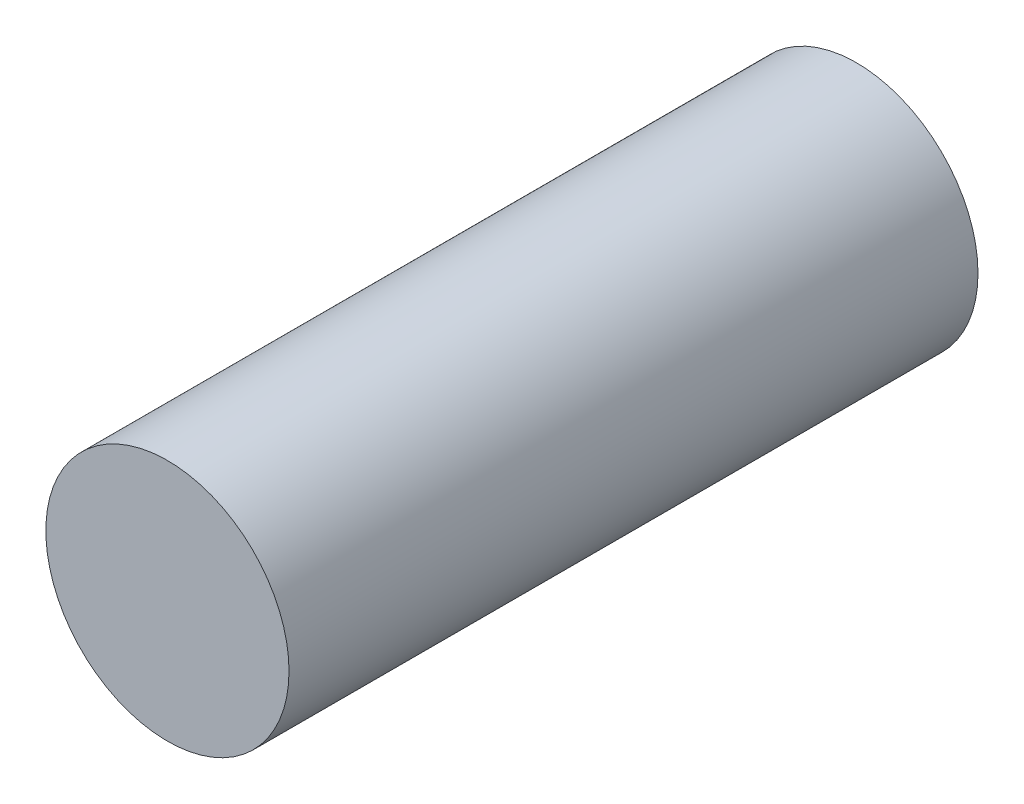
ISO-10303-21;
HEADER;
FILE_DESCRIPTION(('STEP AP214'),'2;1');
FILE_NAME('part.step','',(''),(''),'','','');
FILE_SCHEMA(('AUTOMOTIVE_DESIGN { 1 0 10303 214 1 1 1 1 }'));
ENDSEC;
DATA;
#1=APPLICATION_CONTEXT('core data for automotive mechanical design processes');
#2=APPLICATION_PROTOCOL_DEFINITION('international standard','automotive_design',2000,#1);
#3=PRODUCT_CONTEXT('',#1,'mechanical');
#4=PRODUCT('Part','Part','',(#3));
#5=PRODUCT_RELATED_PRODUCT_CATEGORY('part','',(#4));
#6=PRODUCT_DEFINITION_FORMATION('','',#4);
#7=PRODUCT_DEFINITION_CONTEXT('part definition',#1,'design');
#8=PRODUCT_DEFINITION('design','',#6,#7);
#9=PRODUCT_DEFINITION_SHAPE('','',#8);
#10=(LENGTH_UNIT() NAMED_UNIT(*) SI_UNIT(.MILLI.,.METRE.));
#11=(NAMED_UNIT(*) PLANE_ANGLE_UNIT() SI_UNIT($,.RADIAN.));
#12=(NAMED_UNIT(*) SI_UNIT($,.STERADIAN.) SOLID_ANGLE_UNIT());
#13=UNCERTAINTY_MEASURE_WITH_UNIT(LENGTH_MEASURE(1.E-05),#10,'distance_accuracy_value','');
#14=(GEOMETRIC_REPRESENTATION_CONTEXT(3) GLOBAL_UNCERTAINTY_ASSIGNED_CONTEXT((#13)) GLOBAL_UNIT_ASSIGNED_CONTEXT((#10,
#11,#12)) REPRESENTATION_CONTEXT('',''));
#15=CARTESIAN_POINT('',(0.,0.,0.));
#16=DIRECTION('',(0.,0.,1.));
#17=DIRECTION('',(1.,0.,0.));
#18=AXIS2_PLACEMENT_3D('',#15,#16,#17);
#19=CARTESIAN_POINT('',(8.,46.,25.4852813742386));
#20=DIRECTION('',(0.,0.,-1.));
#21=DIRECTION('',(-1.,0.,0.));
#22=AXIS2_PLACEMENT_3D('',#19,#20,#21);
#23=CYLINDRICAL_SURFACE('',#22,3.);
#24=CARTESIAN_POINT('',(8.,46.,0.));
#25=DIRECTION('',(0.,0.,1.));
#26=DIRECTION('',(1.,0.,0.));
#27=AXIS2_PLACEMENT_3D('',#24,#25,#26);
#28=CIRCLE('',#27,3.);
#29=CARTESIAN_POINT('',(11.,46.,0.));
#30=VERTEX_POINT('',#29);
#31=EDGE_CURVE('E39',#30,#30,#28,.T.);
#32=ORIENTED_EDGE('',*,*,#31,.T.);
#33=EDGE_LOOP('',(#32));
#34=FACE_BOUND('',#33,.T.);
#35=CARTESIAN_POINT('',(8.,46.,17.));
#36=DIRECTION('',(0.,0.,1.));
#37=DIRECTION('',(1.,0.,0.));
#38=AXIS2_PLACEMENT_3D('',#35,#36,#37);
#39=CIRCLE('',#38,3.);
#40=CARTESIAN_POINT('',(11.,46.,17.));
#41=VERTEX_POINT('',#40);
#42=EDGE_CURVE('E10',#41,#41,#39,.T.);
#43=ORIENTED_EDGE('',*,*,#42,.F.);
#44=EDGE_LOOP('',(#43));
#45=FACE_BOUND('',#44,.T.);
#46=ADVANCED_FACE('F32',(#34,#45),#23,.T.);
#47=CARTESIAN_POINT('',(8.,46.,0.));
#48=DIRECTION('',(0.,0.,1.));
#49=DIRECTION('',(1.,0.,0.));
#50=AXIS2_PLACEMENT_3D('',#47,#48,#49);
#51=PLANE('',#50);
#52=ORIENTED_EDGE('',*,*,#31,.F.);
#53=EDGE_LOOP('',(#52));
#54=FACE_BOUND('',#53,.T.);
#55=ADVANCED_FACE('F47',(#54),#51,.F.);
#56=CARTESIAN_POINT('',(10.,90.,17.));
#57=DIRECTION('',(0.,0.,1.));
#58=DIRECTION('',(1.,0.,0.));
#59=AXIS2_PLACEMENT_3D('',#56,#57,#58);
#60=PLANE('',#59);
#61=ORIENTED_EDGE('',*,*,#42,.T.);
#62=EDGE_LOOP('',(#61));
#63=FACE_BOUND('',#62,.T.);
#64=ADVANCED_FACE('F34',(#63),#60,.T.);
#65=CLOSED_SHELL('',(#46,#55,#64));
#66=MANIFOLD_SOLID_BREP('B2',#65);
#67=ADVANCED_BREP_SHAPE_REPRESENTATION('',(#18,#66),#14);
#68=SHAPE_DEFINITION_REPRESENTATION(#9,#67);
ENDSEC;
END-ISO-10303-21;
